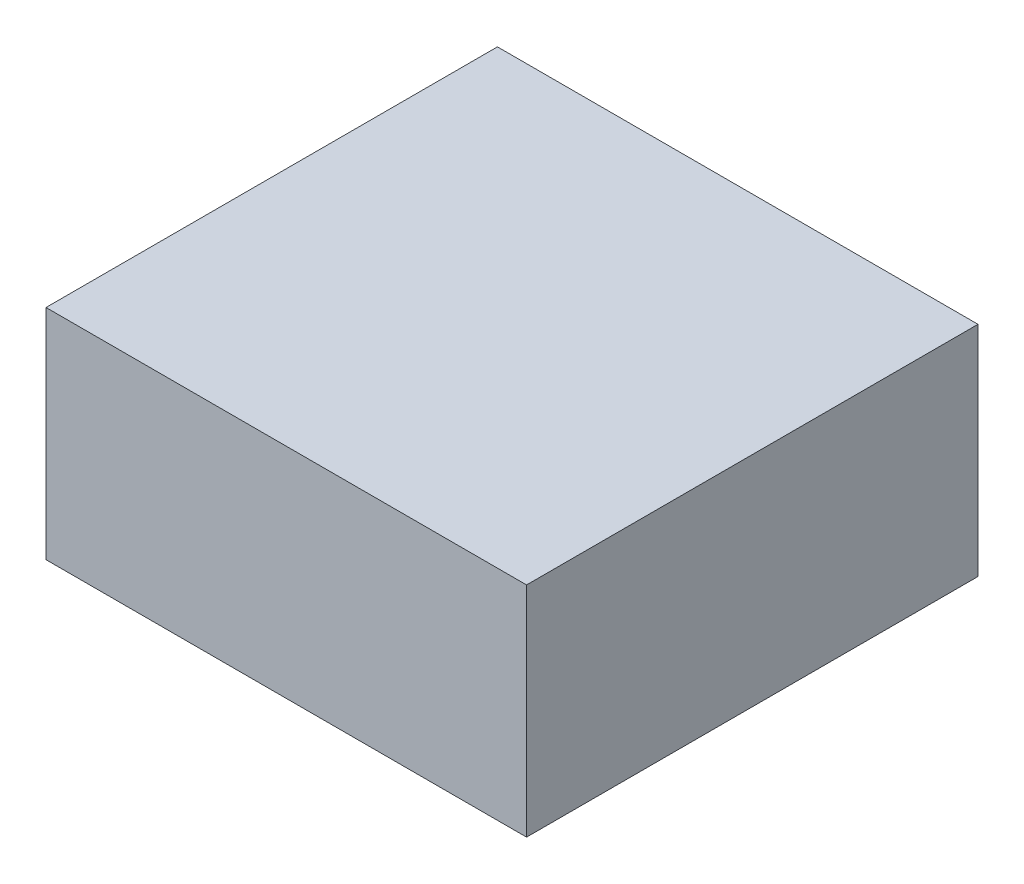
ISO-10303-21;
HEADER;
FILE_DESCRIPTION(('STEP AP214'),'2;1');
FILE_NAME('part.step','',(''),(''),'','','');
FILE_SCHEMA(('AUTOMOTIVE_DESIGN { 1 0 10303 214 1 1 1 1 }'));
ENDSEC;
DATA;
#1=APPLICATION_CONTEXT('core data for automotive mechanical design processes');
#2=APPLICATION_PROTOCOL_DEFINITION('international standard','automotive_design',2000,#1);
#3=PRODUCT_CONTEXT('',#1,'mechanical');
#4=PRODUCT('Part','Part','',(#3));
#5=PRODUCT_RELATED_PRODUCT_CATEGORY('part','',(#4));
#6=PRODUCT_DEFINITION_FORMATION('','',#4);
#7=PRODUCT_DEFINITION_CONTEXT('part definition',#1,'design');
#8=PRODUCT_DEFINITION('design','',#6,#7);
#9=PRODUCT_DEFINITION_SHAPE('','',#8);
#10=(LENGTH_UNIT() NAMED_UNIT(*) SI_UNIT(.MILLI.,.METRE.));
#11=(NAMED_UNIT(*) PLANE_ANGLE_UNIT() SI_UNIT($,.RADIAN.));
#12=(NAMED_UNIT(*) SI_UNIT($,.STERADIAN.) SOLID_ANGLE_UNIT());
#13=UNCERTAINTY_MEASURE_WITH_UNIT(LENGTH_MEASURE(1.E-05),#10,'distance_accuracy_value','');
#14=(GEOMETRIC_REPRESENTATION_CONTEXT(3) GLOBAL_UNCERTAINTY_ASSIGNED_CONTEXT((#13)) GLOBAL_UNIT_ASSIGNED_CONTEXT((#10,
#11,#12)) REPRESENTATION_CONTEXT('',''));
#15=CARTESIAN_POINT('',(0.,0.,0.));
#16=DIRECTION('',(0.,0.,1.));
#17=DIRECTION('',(1.,0.,0.));
#18=AXIS2_PLACEMENT_3D('',#15,#16,#17);
#19=CARTESIAN_POINT('',(-33.,30.,-31.));
#20=DIRECTION('',(1.,0.,0.));
#21=DIRECTION('',(0.,0.,-1.));
#22=AXIS2_PLACEMENT_3D('',#19,#20,#21);
#23=PLANE('',#22);
#24=DIRECTION('',(0.,0.,1.));
#25=VECTOR('',#24,1.);
#26=CARTESIAN_POINT('',(-33.,0.,-31.));
#27=LINE('',#26,#25);
#28=CARTESIAN_POINT('',(-33.,0.,-31.));
#29=VERTEX_POINT('',#28);
#30=CARTESIAN_POINT('',(-33.,0.,31.));
#31=VERTEX_POINT('',#30);
#32=EDGE_CURVE('E96',#29,#31,#27,.T.);
#33=ORIENTED_EDGE('',*,*,#32,.T.);
#34=DIRECTION('',(0.,-1.,0.));
#35=VECTOR('',#34,1.);
#36=CARTESIAN_POINT('',(-33.,30.,31.));
#37=LINE('',#36,#35);
#38=CARTESIAN_POINT('',(-33.,30.,31.));
#39=VERTEX_POINT('',#38);
#40=EDGE_CURVE('E11',#39,#31,#37,.T.);
#41=ORIENTED_EDGE('',*,*,#40,.F.);
#42=DIRECTION('',(0.,0.,1.));
#43=VECTOR('',#42,1.);
#44=CARTESIAN_POINT('',(-33.,30.,-31.));
#45=LINE('',#44,#43);
#46=CARTESIAN_POINT('',(-33.,30.,-31.));
#47=VERTEX_POINT('',#46);
#48=EDGE_CURVE('E84',#47,#39,#45,.T.);
#49=ORIENTED_EDGE('',*,*,#48,.F.);
#50=DIRECTION('',(0.,-1.,0.));
#51=VECTOR('',#50,1.);
#52=CARTESIAN_POINT('',(-33.,30.,-31.));
#53=LINE('',#52,#51);
#54=EDGE_CURVE('E92',#47,#29,#53,.T.);
#55=ORIENTED_EDGE('',*,*,#54,.T.);
#56=EDGE_LOOP('',(#33,#41,#49,#55));
#57=FACE_BOUND('',#56,.T.);
#58=ADVANCED_FACE('F33',(#57),#23,.F.);
#59=CARTESIAN_POINT('',(33.,30.,31.));
#60=DIRECTION('',(0.,0.,-1.));
#61=DIRECTION('',(-1.,0.,0.));
#62=AXIS2_PLACEMENT_3D('',#59,#60,#61);
#63=PLANE('',#62);
#64=DIRECTION('',(1.,0.,0.));
#65=VECTOR('',#64,1.);
#66=CARTESIAN_POINT('',(33.,0.,31.));
#67=LINE('',#66,#65);
#68=CARTESIAN_POINT('',(33.,0.,31.));
#69=VERTEX_POINT('',#68);
#70=EDGE_CURVE('E88',#31,#69,#67,.T.);
#71=ORIENTED_EDGE('',*,*,#70,.T.);
#72=DIRECTION('',(0.,-1.,0.));
#73=VECTOR('',#72,1.);
#74=CARTESIAN_POINT('',(33.,30.,31.));
#75=LINE('',#74,#73);
#76=CARTESIAN_POINT('',(33.,30.,31.));
#77=VERTEX_POINT('',#76);
#78=EDGE_CURVE('E41',#77,#69,#75,.T.);
#79=ORIENTED_EDGE('',*,*,#78,.F.);
#80=DIRECTION('',(1.,0.,0.));
#81=VECTOR('',#80,1.);
#82=CARTESIAN_POINT('',(33.,30.,31.));
#83=LINE('',#82,#81);
#84=EDGE_CURVE('E79',#39,#77,#83,.T.);
#85=ORIENTED_EDGE('',*,*,#84,.F.);
#86=ORIENTED_EDGE('',*,*,#40,.T.);
#87=EDGE_LOOP('',(#71,#79,#85,#86));
#88=FACE_BOUND('',#87,.T.);
#89=ADVANCED_FACE('F87',(#88),#63,.F.);
#90=CARTESIAN_POINT('',(33.,30.,-31.));
#91=DIRECTION('',(-1.,0.,0.));
#92=DIRECTION('',(0.,0.,1.));
#93=AXIS2_PLACEMENT_3D('',#90,#91,#92);
#94=PLANE('',#93);
#95=DIRECTION('',(0.,0.,-1.));
#96=VECTOR('',#95,1.);
#97=CARTESIAN_POINT('',(33.,0.,-31.));
#98=LINE('',#97,#96);
#99=CARTESIAN_POINT('',(33.,0.,-31.));
#100=VERTEX_POINT('',#99);
#101=EDGE_CURVE('E66',#69,#100,#98,.T.);
#102=ORIENTED_EDGE('',*,*,#101,.T.);
#103=DIRECTION('',(0.,-1.,0.));
#104=VECTOR('',#103,1.);
#105=CARTESIAN_POINT('',(33.,30.,-31.));
#106=LINE('',#105,#104);
#107=CARTESIAN_POINT('',(33.,30.,-31.));
#108=VERTEX_POINT('',#107);
#109=EDGE_CURVE('E89',#108,#100,#106,.T.);
#110=ORIENTED_EDGE('',*,*,#109,.F.);
#111=DIRECTION('',(0.,0.,-1.));
#112=VECTOR('',#111,1.);
#113=CARTESIAN_POINT('',(33.,30.,-31.));
#114=LINE('',#113,#112);
#115=EDGE_CURVE('E82',#77,#108,#114,.T.);
#116=ORIENTED_EDGE('',*,*,#115,.F.);
#117=ORIENTED_EDGE('',*,*,#78,.T.);
#118=EDGE_LOOP('',(#102,#110,#116,#117));
#119=FACE_BOUND('',#118,.T.);
#120=ADVANCED_FACE('F90',(#119),#94,.F.);
#121=CARTESIAN_POINT('',(33.,30.,-31.));
#122=DIRECTION('',(0.,0.,1.));
#123=DIRECTION('',(1.,0.,0.));
#124=AXIS2_PLACEMENT_3D('',#121,#122,#123);
#125=PLANE('',#124);
#126=DIRECTION('',(-1.,0.,0.));
#127=VECTOR('',#126,1.);
#128=CARTESIAN_POINT('',(33.,0.,-31.));
#129=LINE('',#128,#127);
#130=EDGE_CURVE('E72',#100,#29,#129,.T.);
#131=ORIENTED_EDGE('',*,*,#130,.T.);
#132=ORIENTED_EDGE('',*,*,#54,.F.);
#133=DIRECTION('',(-1.,0.,0.));
#134=VECTOR('',#133,1.);
#135=CARTESIAN_POINT('',(33.,30.,-31.));
#136=LINE('',#135,#134);
#137=EDGE_CURVE('E49',#108,#47,#136,.T.);
#138=ORIENTED_EDGE('',*,*,#137,.F.);
#139=ORIENTED_EDGE('',*,*,#109,.T.);
#140=EDGE_LOOP('',(#131,#132,#138,#139));
#141=FACE_BOUND('',#140,.T.);
#142=ADVANCED_FACE('F103',(#141),#125,.F.);
#143=CARTESIAN_POINT('',(0.,30.,0.));
#144=DIRECTION('',(0.,-1.,0.));
#145=DIRECTION('',(0.,0.,-1.));
#146=AXIS2_PLACEMENT_3D('',#143,#144,#145);
#147=PLANE('',#146);
#148=ORIENTED_EDGE('',*,*,#48,.T.);
#149=ORIENTED_EDGE('',*,*,#84,.T.);
#150=ORIENTED_EDGE('',*,*,#115,.T.);
#151=ORIENTED_EDGE('',*,*,#137,.T.);
#152=EDGE_LOOP('',(#148,#149,#150,#151));
#153=FACE_BOUND('',#152,.T.);
#154=ADVANCED_FACE('F80',(#153),#147,.F.);
#155=CARTESIAN_POINT('',(0.,0.,0.));
#156=DIRECTION('',(0.,-1.,0.));
#157=DIRECTION('',(0.,0.,-1.));
#158=AXIS2_PLACEMENT_3D('',#155,#156,#157);
#159=PLANE('',#158);
#160=ORIENTED_EDGE('',*,*,#32,.F.);
#161=ORIENTED_EDGE('',*,*,#130,.F.);
#162=ORIENTED_EDGE('',*,*,#101,.F.);
#163=ORIENTED_EDGE('',*,*,#70,.F.);
#164=EDGE_LOOP('',(#160,#161,#162,#163));
#165=FACE_BOUND('',#164,.T.);
#166=ADVANCED_FACE('F106',(#165),#159,.T.);
#167=CLOSED_SHELL('',(#58,#89,#120,#142,#154,#166));
#168=MANIFOLD_SOLID_BREP('B2',#167);
#169=ADVANCED_BREP_SHAPE_REPRESENTATION('',(#18,#168),#14);
#170=SHAPE_DEFINITION_REPRESENTATION(#9,#169);
ENDSEC;
END-ISO-10303-21;
